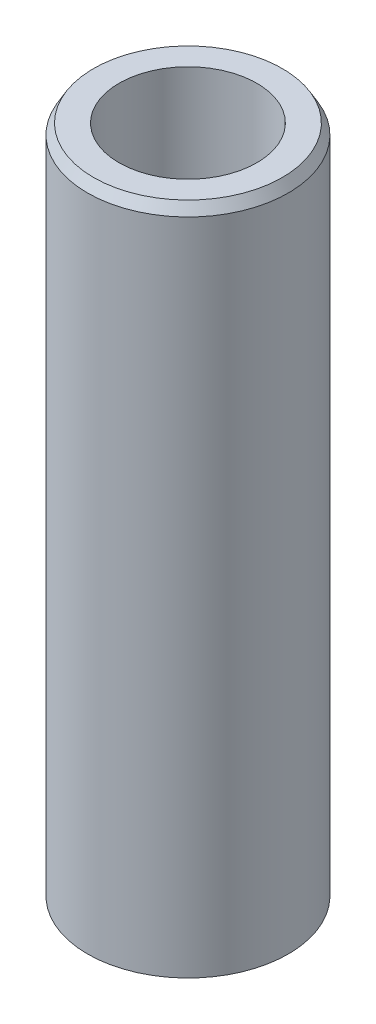
ISO-10303-21;
HEADER;
FILE_DESCRIPTION(('STEP AP214'),'2;1');
FILE_NAME('part.step','',(''),(''),'','','');
FILE_SCHEMA(('AUTOMOTIVE_DESIGN { 1 0 10303 214 1 1 1 1 }'));
ENDSEC;
DATA;
#1=APPLICATION_CONTEXT('core data for automotive mechanical design processes');
#2=APPLICATION_PROTOCOL_DEFINITION('international standard','automotive_design',2000,#1);
#3=PRODUCT_CONTEXT('',#1,'mechanical');
#4=PRODUCT('Part','Part','',(#3));
#5=PRODUCT_RELATED_PRODUCT_CATEGORY('part','',(#4));
#6=PRODUCT_DEFINITION_FORMATION('','',#4);
#7=PRODUCT_DEFINITION_CONTEXT('part definition',#1,'design');
#8=PRODUCT_DEFINITION('design','',#6,#7);
#9=PRODUCT_DEFINITION_SHAPE('','',#8);
#10=(LENGTH_UNIT() NAMED_UNIT(*) SI_UNIT(.MILLI.,.METRE.));
#11=(NAMED_UNIT(*) PLANE_ANGLE_UNIT() SI_UNIT($,.RADIAN.));
#12=(NAMED_UNIT(*) SI_UNIT($,.STERADIAN.) SOLID_ANGLE_UNIT());
#13=UNCERTAINTY_MEASURE_WITH_UNIT(LENGTH_MEASURE(1.E-05),#10,'distance_accuracy_value','');
#14=(GEOMETRIC_REPRESENTATION_CONTEXT(3) GLOBAL_UNCERTAINTY_ASSIGNED_CONTEXT((#13)) GLOBAL_UNIT_ASSIGNED_CONTEXT((#10,
#11,#12)) REPRESENTATION_CONTEXT('',''));
#15=CARTESIAN_POINT('',(0.,0.,0.));
#16=DIRECTION('',(0.,0.,1.));
#17=DIRECTION('',(1.,0.,0.));
#18=AXIS2_PLACEMENT_3D('',#15,#16,#17);
#19=CARTESIAN_POINT('',(0.,370.017684342886,0.));
#20=DIRECTION('',(0.,-1.,0.));
#21=DIRECTION('',(0.,0.,-1.));
#22=AXIS2_PLACEMENT_3D('',#19,#20,#21);
#23=CYLINDRICAL_SURFACE('',#22,55.);
#24=CARTESIAN_POINT('',(0.,364.309626600757,0.));
#25=DIRECTION('',(0.,1.,0.));
#26=DIRECTION('',(0.,0.,1.));
#27=AXIS2_PLACEMENT_3D('',#24,#25,#26);
#28=CIRCLE('',#27,55.);
#29=CARTESIAN_POINT('',(0.,364.309626600757,55.));
#30=VERTEX_POINT('',#29);
#31=EDGE_CURVE('E50',#30,#30,#28,.F.);
#32=ORIENTED_EDGE('',*,*,#31,.T.);
#33=EDGE_LOOP('',(#32));
#34=FACE_BOUND('',#33,.T.);
#35=CARTESIAN_POINT('',(0.,3.29554867396825,0.));
#36=DIRECTION('',(0.,1.,0.));
#37=DIRECTION('',(0.,0.,1.));
#38=AXIS2_PLACEMENT_3D('',#35,#36,#37);
#39=CIRCLE('',#38,55.);
#40=CARTESIAN_POINT('',(0.,3.29554867396825,55.));
#41=VERTEX_POINT('',#40);
#42=EDGE_CURVE('E51',#41,#41,#39,.T.);
#43=ORIENTED_EDGE('',*,*,#42,.T.);
#44=EDGE_LOOP('',(#43));
#45=FACE_BOUND('',#44,.T.);
#46=ADVANCED_FACE('F39',(#34,#45),#23,.T.);
#47=CARTESIAN_POINT('',(0.,370.017684342886,0.));
#48=DIRECTION('',(0.,1.,0.));
#49=DIRECTION('',(0.,0.,1.));
#50=AXIS2_PLACEMENT_3D('',#47,#48,#49);
#51=PLANE('',#50);
#52=CARTESIAN_POINT('',(0.,370.017684342886,0.));
#53=DIRECTION('',(0.,1.,0.));
#54=DIRECTION('',(0.,0.,1.));
#55=AXIS2_PLACEMENT_3D('',#52,#53,#54);
#56=CIRCLE('',#55,51.7044513260317);
#57=CARTESIAN_POINT('',(0.,370.017684342886,51.7044513260317));
#58=VERTEX_POINT('',#57);
#59=EDGE_CURVE('E54',#58,#58,#56,.T.);
#60=ORIENTED_EDGE('',*,*,#59,.T.);
#61=EDGE_LOOP('',(#60));
#62=FACE_BOUND('',#61,.T.);
#63=CARTESIAN_POINT('',(0.,370.017684342886,0.));
#64=DIRECTION('',(0.,1.,0.));
#65=DIRECTION('',(0.,0.,1.));
#66=AXIS2_PLACEMENT_3D('',#63,#64,#65);
#67=CIRCLE('',#66,37.7478679690438);
#68=CARTESIAN_POINT('',(0.,370.017684342886,37.7478679690438));
#69=VERTEX_POINT('',#68);
#70=EDGE_CURVE('E58',#69,#69,#67,.T.);
#71=ORIENTED_EDGE('',*,*,#70,.F.);
#72=EDGE_LOOP('',(#71));
#73=FACE_BOUND('',#72,.T.);
#74=ADVANCED_FACE('F69',(#62,#73),#51,.T.);
#75=CARTESIAN_POINT('',(0.,0.,0.));
#76=DIRECTION('',(0.,1.,0.));
#77=DIRECTION('',(0.,0.,1.));
#78=AXIS2_PLACEMENT_3D('',#75,#76,#77);
#79=PLANE('',#78);
#80=CARTESIAN_POINT('',(0.,0.,0.));
#81=DIRECTION('',(0.,1.,0.));
#82=DIRECTION('',(0.,0.,1.));
#83=AXIS2_PLACEMENT_3D('',#80,#81,#82);
#84=CIRCLE('',#83,49.2919422578706);
#85=CARTESIAN_POINT('',(0.,0.,49.2919422578706));
#86=VERTEX_POINT('',#85);
#87=EDGE_CURVE('E10',#86,#86,#84,.F.);
#88=ORIENTED_EDGE('',*,*,#87,.T.);
#89=EDGE_LOOP('',(#88));
#90=FACE_BOUND('',#89,.T.);
#91=CARTESIAN_POINT('',(0.,0.,0.));
#92=DIRECTION('',(0.,1.,0.));
#93=DIRECTION('',(0.,0.,1.));
#94=AXIS2_PLACEMENT_3D('',#91,#92,#93);
#95=CIRCLE('',#94,37.7478679690438);
#96=CARTESIAN_POINT('',(0.,0.,37.7478679690438));
#97=VERTEX_POINT('',#96);
#98=EDGE_CURVE('E63',#97,#97,#95,.T.);
#99=ORIENTED_EDGE('',*,*,#98,.T.);
#100=EDGE_LOOP('',(#99));
#101=FACE_BOUND('',#100,.T.);
#102=ADVANCED_FACE('F75',(#90,#101),#79,.F.);
#103=CARTESIAN_POINT('',(0.,370.017684342886,0.));
#104=DIRECTION('',(0.,-1.,0.));
#105=DIRECTION('',(0.,0.,-1.));
#106=AXIS2_PLACEMENT_3D('',#103,#104,#105);
#107=CYLINDRICAL_SURFACE('',#106,37.7478679690438);
#108=ORIENTED_EDGE('',*,*,#70,.T.);
#109=EDGE_LOOP('',(#108));
#110=FACE_BOUND('',#109,.T.);
#111=ORIENTED_EDGE('',*,*,#98,.F.);
#112=EDGE_LOOP('',(#111));
#113=FACE_BOUND('',#112,.T.);
#114=ADVANCED_FACE('F70',(#110,#113),#107,.F.);
#115=CARTESIAN_POINT('',(0.,370.017684342886,0.));
#116=DIRECTION('',(0.,-1.,0.));
#117=DIRECTION('',(0.,0.,-1.));
#118=AXIS2_PLACEMENT_3D('',#115,#116,#117);
#119=CONICAL_SURFACE('',#118,51.7044513260317,0.523598775598296);
#120=ORIENTED_EDGE('',*,*,#31,.F.);
#121=EDGE_LOOP('',(#120));
#122=FACE_BOUND('',#121,.T.);
#123=ORIENTED_EDGE('',*,*,#59,.F.);
#124=EDGE_LOOP('',(#123));
#125=FACE_BOUND('',#124,.T.);
#126=ADVANCED_FACE('F81',(#122,#125),#119,.T.);
#127=CARTESIAN_POINT('',(0.,3.29554867396825,0.));
#128=DIRECTION('',(0.,1.,0.));
#129=DIRECTION('',(0.,0.,1.));
#130=AXIS2_PLACEMENT_3D('',#127,#128,#129);
#131=CONICAL_SURFACE('',#130,55.,1.04719755119661);
#132=ORIENTED_EDGE('',*,*,#87,.F.);
#133=EDGE_LOOP('',(#132));
#134=FACE_BOUND('',#133,.T.);
#135=ORIENTED_EDGE('',*,*,#42,.F.);
#136=EDGE_LOOP('',(#135));
#137=FACE_BOUND('',#136,.T.);
#138=ADVANCED_FACE('F45',(#134,#137),#131,.T.);
#139=CLOSED_SHELL('',(#46,#74,#102,#114,#126,#138));
#140=MANIFOLD_SOLID_BREP('B2',#139);
#141=ADVANCED_BREP_SHAPE_REPRESENTATION('',(#18,#140),#14);
#142=SHAPE_DEFINITION_REPRESENTATION(#9,#141);
ENDSEC;
END-ISO-10303-21;
